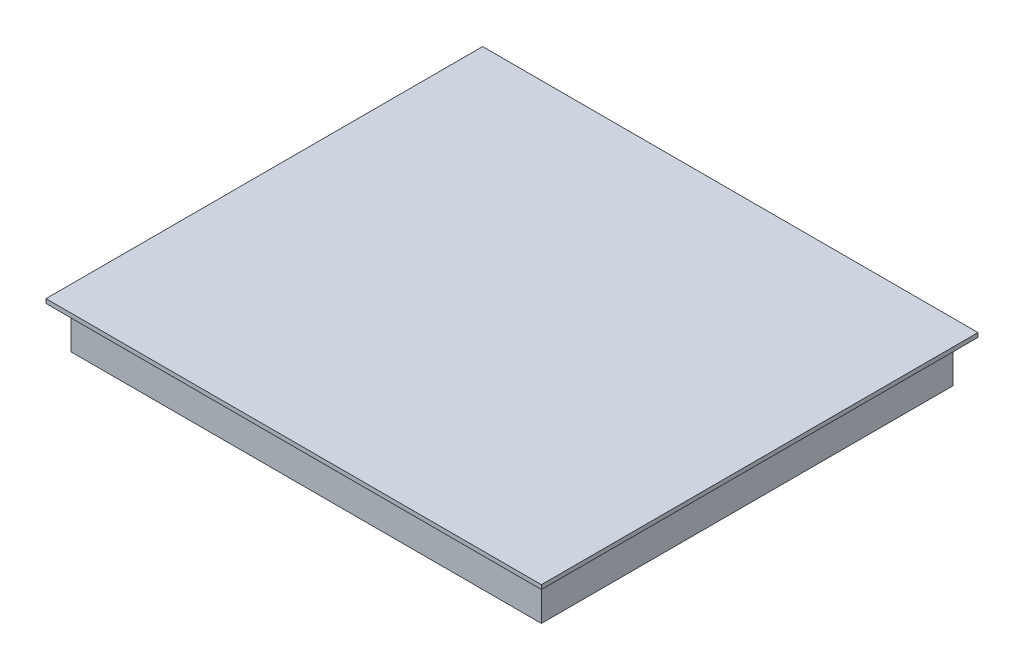
ISO-10303-21;
HEADER;
FILE_DESCRIPTION(('STEP AP214'),'2;1');
FILE_NAME('part.step','',(''),(''),'','','');
FILE_SCHEMA(('AUTOMOTIVE_DESIGN { 1 0 10303 214 1 1 1 1 }'));
ENDSEC;
DATA;
#1=APPLICATION_CONTEXT('core data for automotive mechanical design processes');
#2=APPLICATION_PROTOCOL_DEFINITION('international standard','automotive_design',2000,#1);
#3=PRODUCT_CONTEXT('',#1,'mechanical');
#4=PRODUCT('Part','Part','',(#3));
#5=PRODUCT_RELATED_PRODUCT_CATEGORY('part','',(#4));
#6=PRODUCT_DEFINITION_FORMATION('','',#4);
#7=PRODUCT_DEFINITION_CONTEXT('part definition',#1,'design');
#8=PRODUCT_DEFINITION('design','',#6,#7);
#9=PRODUCT_DEFINITION_SHAPE('','',#8);
#10=(LENGTH_UNIT() NAMED_UNIT(*) SI_UNIT(.MILLI.,.METRE.));
#11=(NAMED_UNIT(*) PLANE_ANGLE_UNIT() SI_UNIT($,.RADIAN.));
#12=(NAMED_UNIT(*) SI_UNIT($,.STERADIAN.) SOLID_ANGLE_UNIT());
#13=UNCERTAINTY_MEASURE_WITH_UNIT(LENGTH_MEASURE(1.E-05),#10,'distance_accuracy_value','');
#14=(GEOMETRIC_REPRESENTATION_CONTEXT(3) GLOBAL_UNCERTAINTY_ASSIGNED_CONTEXT((#13)) GLOBAL_UNIT_ASSIGNED_CONTEXT((#10,
#11,#12)) REPRESENTATION_CONTEXT('',''));
#15=CARTESIAN_POINT('',(0.,0.,0.));
#16=DIRECTION('',(0.,0.,1.));
#17=DIRECTION('',(1.,0.,0.));
#18=AXIS2_PLACEMENT_3D('',#15,#16,#17);
#19=CARTESIAN_POINT('',(280.,50.,-245.));
#20=DIRECTION('',(-1.,0.,0.));
#21=DIRECTION('',(0.,0.,1.));
#22=AXIS2_PLACEMENT_3D('',#19,#20,#21);
#23=PLANE('',#22);
#24=DIRECTION('',(0.,0.,-1.));
#25=VECTOR('',#24,1.);
#26=CARTESIAN_POINT('',(280.,0.,-245.));
#27=LINE('',#26,#25);
#28=CARTESIAN_POINT('',(280.,0.,245.));
#29=VERTEX_POINT('',#28);
#30=CARTESIAN_POINT('',(280.,0.,-245.));
#31=VERTEX_POINT('',#30);
#32=EDGE_CURVE('E141',#29,#31,#27,.T.);
#33=ORIENTED_EDGE('',*,*,#32,.T.);
#34=DIRECTION('',(0.,-1.,0.));
#35=VECTOR('',#34,1.);
#36=CARTESIAN_POINT('',(280.,50.,-245.));
#37=LINE('',#36,#35);
#38=CARTESIAN_POINT('',(280.,50.,-245.));
#39=VERTEX_POINT('',#38);
#40=EDGE_CURVE('E11',#39,#31,#37,.T.);
#41=ORIENTED_EDGE('',*,*,#40,.F.);
#42=DIRECTION('',(0.,0.,-1.));
#43=VECTOR('',#42,1.);
#44=CARTESIAN_POINT('',(280.,50.,-245.));
#45=LINE('',#44,#43);
#46=CARTESIAN_POINT('',(280.,50.,245.));
#47=VERTEX_POINT('',#46);
#48=EDGE_CURVE('E152',#47,#39,#45,.T.);
#49=ORIENTED_EDGE('',*,*,#48,.F.);
#50=DIRECTION('',(0.,-1.,0.));
#51=VECTOR('',#50,1.);
#52=CARTESIAN_POINT('',(280.,50.,245.));
#53=LINE('',#52,#51);
#54=EDGE_CURVE('E165',#47,#29,#53,.T.);
#55=ORIENTED_EDGE('',*,*,#54,.T.);
#56=EDGE_LOOP('',(#33,#41,#49,#55));
#57=FACE_BOUND('',#56,.T.);
#58=ADVANCED_FACE('F39',(#57),#23,.F.);
#59=CARTESIAN_POINT('',(-280.,50.,-245.));
#60=DIRECTION('',(0.,0.,1.));
#61=DIRECTION('',(1.,0.,0.));
#62=AXIS2_PLACEMENT_3D('',#59,#60,#61);
#63=PLANE('',#62);
#64=DIRECTION('',(-1.,0.,0.));
#65=VECTOR('',#64,1.);
#66=CARTESIAN_POINT('',(-280.,0.,-245.));
#67=LINE('',#66,#65);
#68=CARTESIAN_POINT('',(-280.,0.,-245.));
#69=VERTEX_POINT('',#68);
#70=EDGE_CURVE('E146',#31,#69,#67,.T.);
#71=ORIENTED_EDGE('',*,*,#70,.T.);
#72=DIRECTION('',(0.,-1.,0.));
#73=VECTOR('',#72,1.);
#74=CARTESIAN_POINT('',(-280.,50.,-245.));
#75=LINE('',#74,#73);
#76=CARTESIAN_POINT('',(-280.,50.,-245.));
#77=VERTEX_POINT('',#76);
#78=EDGE_CURVE('E48',#77,#69,#75,.T.);
#79=ORIENTED_EDGE('',*,*,#78,.F.);
#80=DIRECTION('',(-1.,0.,0.));
#81=VECTOR('',#80,1.);
#82=CARTESIAN_POINT('',(-280.,50.,-245.));
#83=LINE('',#82,#81);
#84=EDGE_CURVE('E82',#39,#77,#83,.T.);
#85=ORIENTED_EDGE('',*,*,#84,.F.);
#86=ORIENTED_EDGE('',*,*,#40,.T.);
#87=EDGE_LOOP('',(#71,#79,#85,#86));
#88=FACE_BOUND('',#87,.T.);
#89=ADVANCED_FACE('F197',(#88),#63,.F.);
#90=CARTESIAN_POINT('',(-280.,50.,-245.));
#91=DIRECTION('',(1.,0.,0.));
#92=DIRECTION('',(0.,0.,-1.));
#93=AXIS2_PLACEMENT_3D('',#90,#91,#92);
#94=PLANE('',#93);
#95=DIRECTION('',(0.,0.,1.));
#96=VECTOR('',#95,1.);
#97=CARTESIAN_POINT('',(-280.,0.,-245.));
#98=LINE('',#97,#96);
#99=CARTESIAN_POINT('',(-280.,0.,245.));
#100=VERTEX_POINT('',#99);
#101=EDGE_CURVE('E72',#69,#100,#98,.T.);
#102=ORIENTED_EDGE('',*,*,#101,.T.);
#103=DIRECTION('',(0.,-1.,0.));
#104=VECTOR('',#103,1.);
#105=CARTESIAN_POINT('',(-280.,50.,245.));
#106=LINE('',#105,#104);
#107=CARTESIAN_POINT('',(-280.,50.,245.));
#108=VERTEX_POINT('',#107);
#109=EDGE_CURVE('E56',#108,#100,#106,.T.);
#110=ORIENTED_EDGE('',*,*,#109,.F.);
#111=DIRECTION('',(0.,0.,1.));
#112=VECTOR('',#111,1.);
#113=CARTESIAN_POINT('',(-280.,50.,-245.));
#114=LINE('',#113,#112);
#115=EDGE_CURVE('E158',#77,#108,#114,.T.);
#116=ORIENTED_EDGE('',*,*,#115,.F.);
#117=ORIENTED_EDGE('',*,*,#78,.T.);
#118=EDGE_LOOP('',(#102,#110,#116,#117));
#119=FACE_BOUND('',#118,.T.);
#120=ADVANCED_FACE('F177',(#119),#94,.F.);
#121=CARTESIAN_POINT('',(-280.,50.,245.));
#122=DIRECTION('',(0.,0.,-1.));
#123=DIRECTION('',(-1.,0.,0.));
#124=AXIS2_PLACEMENT_3D('',#121,#122,#123);
#125=PLANE('',#124);
#126=DIRECTION('',(1.,0.,0.));
#127=VECTOR('',#126,1.);
#128=CARTESIAN_POINT('',(-280.,0.,245.));
#129=LINE('',#128,#127);
#130=EDGE_CURVE('E77',#100,#29,#129,.T.);
#131=ORIENTED_EDGE('',*,*,#130,.T.);
#132=ORIENTED_EDGE('',*,*,#54,.F.);
#133=DIRECTION('',(1.,0.,0.));
#134=VECTOR('',#133,1.);
#135=CARTESIAN_POINT('',(-280.,50.,245.));
#136=LINE('',#135,#134);
#137=EDGE_CURVE('E162',#108,#47,#136,.T.);
#138=ORIENTED_EDGE('',*,*,#137,.F.);
#139=ORIENTED_EDGE('',*,*,#109,.T.);
#140=EDGE_LOOP('',(#131,#132,#138,#139));
#141=FACE_BOUND('',#140,.T.);
#142=ADVANCED_FACE('F182',(#141),#125,.F.);
#143=CARTESIAN_POINT('',(0.,0.,0.));
#144=DIRECTION('',(0.,1.,0.));
#145=DIRECTION('',(0.,0.,1.));
#146=AXIS2_PLACEMENT_3D('',#143,#144,#145);
#147=PLANE('',#146);
#148=ORIENTED_EDGE('',*,*,#32,.F.);
#149=ORIENTED_EDGE('',*,*,#130,.F.);
#150=ORIENTED_EDGE('',*,*,#101,.F.);
#151=ORIENTED_EDGE('',*,*,#70,.F.);
#152=EDGE_LOOP('',(#148,#149,#150,#151));
#153=FACE_BOUND('',#152,.T.);
#154=ADVANCED_FACE('F180',(#153),#147,.F.);
#155=CARTESIAN_POINT('',(0.,50.,0.));
#156=DIRECTION('',(0.,1.,0.));
#157=DIRECTION('',(0.,0.,1.));
#158=AXIS2_PLACEMENT_3D('',#155,#156,#157);
#159=PLANE('',#158);
#160=DIRECTION('',(0.,0.,-1.));
#161=VECTOR('',#160,1.);
#162=CARTESIAN_POINT('',(295.,50.,-260.));
#163=LINE('',#162,#161);
#164=CARTESIAN_POINT('',(295.,50.,260.));
#165=VERTEX_POINT('',#164);
#166=CARTESIAN_POINT('',(295.,50.,-260.));
#167=VERTEX_POINT('',#166);
#168=EDGE_CURVE('E139',#165,#167,#163,.T.);
#169=ORIENTED_EDGE('',*,*,#168,.F.);
#170=DIRECTION('',(1.,0.,0.));
#171=VECTOR('',#170,1.);
#172=CARTESIAN_POINT('',(-295.,50.,260.));
#173=LINE('',#172,#171);
#174=CARTESIAN_POINT('',(-295.,50.,260.));
#175=VERTEX_POINT('',#174);
#176=EDGE_CURVE('E135',#175,#165,#173,.T.);
#177=ORIENTED_EDGE('',*,*,#176,.F.);
#178=DIRECTION('',(0.,0.,1.));
#179=VECTOR('',#178,1.);
#180=CARTESIAN_POINT('',(-295.,50.,-260.));
#181=LINE('',#180,#179);
#182=CARTESIAN_POINT('',(-295.,50.,-260.));
#183=VERTEX_POINT('',#182);
#184=EDGE_CURVE('E225',#183,#175,#181,.T.);
#185=ORIENTED_EDGE('',*,*,#184,.F.);
#186=DIRECTION('',(-1.,0.,0.));
#187=VECTOR('',#186,1.);
#188=CARTESIAN_POINT('',(-295.,50.,-260.));
#189=LINE('',#188,#187);
#190=EDGE_CURVE('E229',#167,#183,#189,.T.);
#191=ORIENTED_EDGE('',*,*,#190,.F.);
#192=EDGE_LOOP('',(#169,#177,#185,#191));
#193=FACE_BOUND('',#192,.T.);
#194=ORIENTED_EDGE('',*,*,#137,.T.);
#195=ORIENTED_EDGE('',*,*,#48,.T.);
#196=ORIENTED_EDGE('',*,*,#84,.T.);
#197=ORIENTED_EDGE('',*,*,#115,.T.);
#198=EDGE_LOOP('',(#194,#195,#196,#197));
#199=FACE_BOUND('',#198,.T.);
#200=ADVANCED_FACE('F184',(#193,#199),#159,.F.);
#201=CARTESIAN_POINT('',(295.,55.,-260.));
#202=DIRECTION('',(-1.,0.,0.));
#203=DIRECTION('',(0.,0.,1.));
#204=AXIS2_PLACEMENT_3D('',#201,#202,#203);
#205=PLANE('',#204);
#206=ORIENTED_EDGE('',*,*,#168,.T.);
#207=DIRECTION('',(0.,-1.,0.));
#208=VECTOR('',#207,1.);
#209=CARTESIAN_POINT('',(295.,55.,-260.));
#210=LINE('',#209,#208);
#211=CARTESIAN_POINT('',(295.,55.,-260.));
#212=VERTEX_POINT('',#211);
#213=EDGE_CURVE('E117',#212,#167,#210,.T.);
#214=ORIENTED_EDGE('',*,*,#213,.F.);
#215=DIRECTION('',(0.,0.,-1.));
#216=VECTOR('',#215,1.);
#217=CARTESIAN_POINT('',(295.,55.,-260.));
#218=LINE('',#217,#216);
#219=CARTESIAN_POINT('',(295.,55.,260.));
#220=VERTEX_POINT('',#219);
#221=EDGE_CURVE('E125',#220,#212,#218,.T.);
#222=ORIENTED_EDGE('',*,*,#221,.F.);
#223=DIRECTION('',(0.,-1.,0.));
#224=VECTOR('',#223,1.);
#225=CARTESIAN_POINT('',(295.,55.,260.));
#226=LINE('',#225,#224);
#227=EDGE_CURVE('E221',#220,#165,#226,.T.);
#228=ORIENTED_EDGE('',*,*,#227,.T.);
#229=EDGE_LOOP('',(#206,#214,#222,#228));
#230=FACE_BOUND('',#229,.T.);
#231=ADVANCED_FACE('F137',(#230),#205,.F.);
#232=CARTESIAN_POINT('',(-295.,55.,-260.));
#233=DIRECTION('',(0.,0.,1.));
#234=DIRECTION('',(1.,0.,0.));
#235=AXIS2_PLACEMENT_3D('',#232,#233,#234);
#236=PLANE('',#235);
#237=ORIENTED_EDGE('',*,*,#190,.T.);
#238=DIRECTION('',(0.,-1.,0.));
#239=VECTOR('',#238,1.);
#240=CARTESIAN_POINT('',(-295.,55.,-260.));
#241=LINE('',#240,#239);
#242=CARTESIAN_POINT('',(-295.,55.,-260.));
#243=VERTEX_POINT('',#242);
#244=EDGE_CURVE('E120',#243,#183,#241,.T.);
#245=ORIENTED_EDGE('',*,*,#244,.F.);
#246=DIRECTION('',(-1.,0.,0.));
#247=VECTOR('',#246,1.);
#248=CARTESIAN_POINT('',(-295.,55.,-260.));
#249=LINE('',#248,#247);
#250=EDGE_CURVE('E113',#212,#243,#249,.T.);
#251=ORIENTED_EDGE('',*,*,#250,.F.);
#252=ORIENTED_EDGE('',*,*,#213,.T.);
#253=EDGE_LOOP('',(#237,#245,#251,#252));
#254=FACE_BOUND('',#253,.T.);
#255=ADVANCED_FACE('F115',(#254),#236,.F.);
#256=CARTESIAN_POINT('',(-295.,55.,-260.));
#257=DIRECTION('',(1.,0.,0.));
#258=DIRECTION('',(0.,0.,-1.));
#259=AXIS2_PLACEMENT_3D('',#256,#257,#258);
#260=PLANE('',#259);
#261=ORIENTED_EDGE('',*,*,#184,.T.);
#262=DIRECTION('',(0.,-1.,0.));
#263=VECTOR('',#262,1.);
#264=CARTESIAN_POINT('',(-295.,55.,260.));
#265=LINE('',#264,#263);
#266=CARTESIAN_POINT('',(-295.,55.,260.));
#267=VERTEX_POINT('',#266);
#268=EDGE_CURVE('E148',#267,#175,#265,.T.);
#269=ORIENTED_EDGE('',*,*,#268,.F.);
#270=DIRECTION('',(0.,0.,1.));
#271=VECTOR('',#270,1.);
#272=CARTESIAN_POINT('',(-295.,55.,-260.));
#273=LINE('',#272,#271);
#274=EDGE_CURVE('E124',#243,#267,#273,.T.);
#275=ORIENTED_EDGE('',*,*,#274,.F.);
#276=ORIENTED_EDGE('',*,*,#244,.T.);
#277=EDGE_LOOP('',(#261,#269,#275,#276));
#278=FACE_BOUND('',#277,.T.);
#279=ADVANCED_FACE('F210',(#278),#260,.F.);
#280=CARTESIAN_POINT('',(-295.,55.,260.));
#281=DIRECTION('',(0.,0.,-1.));
#282=DIRECTION('',(-1.,0.,0.));
#283=AXIS2_PLACEMENT_3D('',#280,#281,#282);
#284=PLANE('',#283);
#285=ORIENTED_EDGE('',*,*,#176,.T.);
#286=ORIENTED_EDGE('',*,*,#227,.F.);
#287=DIRECTION('',(1.,0.,0.));
#288=VECTOR('',#287,1.);
#289=CARTESIAN_POINT('',(-295.,55.,260.));
#290=LINE('',#289,#288);
#291=EDGE_CURVE('E130',#267,#220,#290,.T.);
#292=ORIENTED_EDGE('',*,*,#291,.F.);
#293=ORIENTED_EDGE('',*,*,#268,.T.);
#294=EDGE_LOOP('',(#285,#286,#292,#293));
#295=FACE_BOUND('',#294,.T.);
#296=ADVANCED_FACE('F212',(#295),#284,.F.);
#297=CARTESIAN_POINT('',(0.,55.,0.));
#298=DIRECTION('',(0.,1.,0.));
#299=DIRECTION('',(0.,0.,1.));
#300=AXIS2_PLACEMENT_3D('',#297,#298,#299);
#301=PLANE('',#300);
#302=ORIENTED_EDGE('',*,*,#221,.T.);
#303=ORIENTED_EDGE('',*,*,#250,.T.);
#304=ORIENTED_EDGE('',*,*,#274,.T.);
#305=ORIENTED_EDGE('',*,*,#291,.T.);
#306=EDGE_LOOP('',(#302,#303,#304,#305));
#307=FACE_BOUND('',#306,.T.);
#308=ADVANCED_FACE('F128',(#307),#301,.T.);
#309=CLOSED_SHELL('',(#58,#89,#120,#142,#154,#200,#231,#255,#279,#296,#308));
#310=MANIFOLD_SOLID_BREP('B2',#309);
#311=ADVANCED_BREP_SHAPE_REPRESENTATION('',(#18,#310),#14);
#312=SHAPE_DEFINITION_REPRESENTATION(#9,#311);
ENDSEC;
END-ISO-10303-21;
